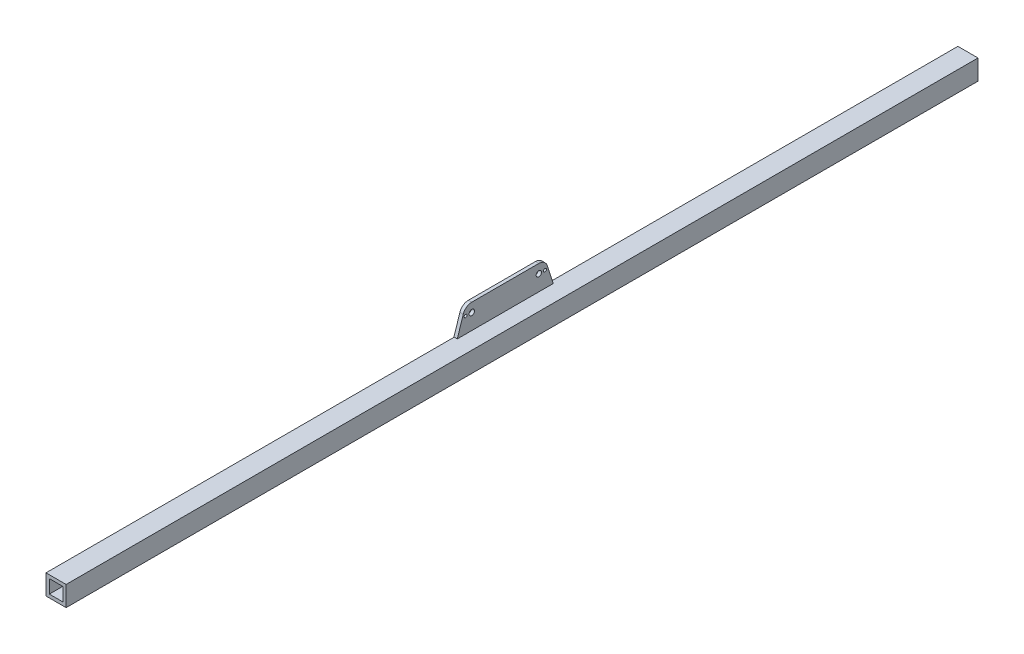
ISO-10303-21;
HEADER;
FILE_DESCRIPTION(('STEP AP214'),'2;1');
FILE_NAME('part.step','',(''),(''),'','','');
FILE_SCHEMA(('AUTOMOTIVE_DESIGN { 1 0 10303 214 1 1 1 1 }'));
ENDSEC;
DATA;
#1=APPLICATION_CONTEXT('core data for automotive mechanical design processes');
#2=APPLICATION_PROTOCOL_DEFINITION('international standard','automotive_design',2000,#1);
#3=PRODUCT_CONTEXT('',#1,'mechanical');
#4=PRODUCT('Part','Part','',(#3));
#5=PRODUCT_RELATED_PRODUCT_CATEGORY('part','',(#4));
#6=PRODUCT_DEFINITION_FORMATION('','',#4);
#7=PRODUCT_DEFINITION_CONTEXT('part definition',#1,'design');
#8=PRODUCT_DEFINITION('design','',#6,#7);
#9=PRODUCT_DEFINITION_SHAPE('','',#8);
#10=(LENGTH_UNIT() NAMED_UNIT(*) SI_UNIT(.MILLI.,.METRE.));
#11=(NAMED_UNIT(*) PLANE_ANGLE_UNIT() SI_UNIT($,.RADIAN.));
#12=(NAMED_UNIT(*) SI_UNIT($,.STERADIAN.) SOLID_ANGLE_UNIT());
#13=UNCERTAINTY_MEASURE_WITH_UNIT(LENGTH_MEASURE(1.E-05),#10,'distance_accuracy_value','');
#14=(GEOMETRIC_REPRESENTATION_CONTEXT(3) GLOBAL_UNCERTAINTY_ASSIGNED_CONTEXT((#13)) GLOBAL_UNIT_ASSIGNED_CONTEXT((#10,
#11,#12)) REPRESENTATION_CONTEXT('',''));
#15=CARTESIAN_POINT('',(0.,0.,0.));
#16=DIRECTION('',(0.,0.,1.));
#17=DIRECTION('',(1.,0.,0.));
#18=AXIS2_PLACEMENT_3D('',#15,#16,#17);
#19=CARTESIAN_POINT('',(-6.35,27.2262178550397,-391.991213097812));
#20=CARTESIAN_POINT('',(-6.35,27.3173707739215,-392.021753734183));
#21=CARTESIAN_POINT('',(-6.35,27.499676611685,-392.082835006924));
#22=CARTESIAN_POINT('',(-6.35,27.7689805937755,-392.186190582249));
#23=CARTESIAN_POINT('',(-6.35,28.0348461149055,-392.297987590747));
#24=CARTESIAN_POINT('',(-6.35,28.2966895976227,-392.418946559684));
#25=CARTESIAN_POINT('',(-6.35,28.6401452697693,-392.591950530516));
#26=CARTESIAN_POINT('',(-6.35,28.9744595417508,-392.782359956122));
#27=CARTESIAN_POINT('',(-6.35,29.298488123748,-392.989491067887));
#28=CARTESIAN_POINT('',(-6.35,29.6442417287719,-393.227477956135));
#29=CARTESIAN_POINT('',(-6.35,30.0800545990652,-393.56566036437));
#30=CARTESIAN_POINT('',(-6.35,30.5846333282074,-394.02614449053));
#31=CARTESIAN_POINT('',(-6.35,31.0505530347622,-394.525938749404));
#32=CARTESIAN_POINT('',(-6.35,31.4733481418253,-395.063532300767));
#33=CARTESIAN_POINT('',(-6.35,31.8532081181751,-395.631258779186));
#34=CARTESIAN_POINT('',(-6.35,32.2962454155091,-396.426610528844));
#35=CARTESIAN_POINT('',(-6.35,32.71705570741,-397.463033708927));
#36=CARTESIAN_POINT('',(-6.35,32.9358696588289,-398.393913098835));
#37=CARTESIAN_POINT('',(-6.35,33.0273729579738,-399.035207634627));
#38=CARTESIAN_POINT('',(-6.35,33.0630756412302,-399.38403619713));
#39=CARTESIAN_POINT('',(-6.35,33.0830265317926,-399.750910150479));
#40=CARTESIAN_POINT('',(-6.35,33.0848497712993,-399.967870418303));
#41=CARTESIAN_POINT('',(-6.35,33.0855399524994,-400.05));
#42=B_SPLINE_CURVE_WITH_KNOTS('',3,(#19,#20,#21,#22,#23,#24,#25,#26,#27,#28,#29,#30,#31,#32,#33,
#34,#35,#36,#37,#38,#39,#40,#41),.UNSPECIFIED.,.F.,.F.,(4,1,1,1,1,1,1,1,1,1,1,1,1,1,1,1,1,1,1,1,
4),(0.,0.0270825226870517,0.0541650453741034,0.0812475680611551,0.108330090748206,
0.135412613435259,0.189577658809362,0.216660181496413,0.243742704183465,0.307821112222937,
0.371897307209133,0.436011013062701,0.500107188986833,0.564389200661177,0.628263610263641,
0.756365308011367,0.87811555285971,0.896531502333321,0.93887405730568,0.976860979410322,1.),.UNSPECIFIED.);
#43=DIRECTION('',(-1.,0.,0.));
#44=VECTOR('',#43,1.);
#45=SURFACE_OF_LINEAR_EXTRUSION('',#42,#44);
#46=CARTESIAN_POINT('',(-9.525,27.2262178550397,-391.991213097812));
#47=CARTESIAN_POINT('',(-9.525,27.3173707739215,-392.021753734183));
#48=CARTESIAN_POINT('',(-9.525,27.499676611685,-392.082835006924));
#49=CARTESIAN_POINT('',(-9.525,27.7689805937755,-392.186190582249));
#50=CARTESIAN_POINT('',(-9.525,28.0348461149055,-392.297987590747));
#51=CARTESIAN_POINT('',(-9.525,28.2966895976227,-392.418946559684));
#52=CARTESIAN_POINT('',(-9.525,28.6401452697693,-392.591950530516));
#53=CARTESIAN_POINT('',(-9.525,28.9744595417508,-392.782359956122));
#54=CARTESIAN_POINT('',(-9.525,29.298488123748,-392.989491067887));
#55=CARTESIAN_POINT('',(-9.525,29.6442417287719,-393.227477956135));
#56=CARTESIAN_POINT('',(-9.525,30.0800545990652,-393.56566036437));
#57=CARTESIAN_POINT('',(-9.525,30.5846333282074,-394.02614449053));
#58=CARTESIAN_POINT('',(-9.525,31.0505530347622,-394.525938749404));
#59=CARTESIAN_POINT('',(-9.525,31.4733481418253,-395.063532300767));
#60=CARTESIAN_POINT('',(-9.525,31.8532081181751,-395.631258779186));
#61=CARTESIAN_POINT('',(-9.525,32.2962454155091,-396.426610528844));
#62=CARTESIAN_POINT('',(-9.525,32.71705570741,-397.463033708927));
#63=CARTESIAN_POINT('',(-9.525,32.9358696588289,-398.393913098835));
#64=CARTESIAN_POINT('',(-9.525,33.0273729579738,-399.035207634627));
#65=CARTESIAN_POINT('',(-9.525,33.0630756412302,-399.38403619713));
#66=CARTESIAN_POINT('',(-9.525,33.0830265317926,-399.750910150479));
#67=CARTESIAN_POINT('',(-9.525,33.0848497712993,-399.967870418303));
#68=CARTESIAN_POINT('',(-9.525,33.0855399524994,-400.05));
#69=B_SPLINE_CURVE_WITH_KNOTS('',3,(#46,#47,#48,#49,#50,#51,#52,#53,#54,#55,#56,#57,#58,#59,#60,
#61,#62,#63,#64,#65,#66,#67,#68),.UNSPECIFIED.,.F.,.F.,(4,1,1,1,1,1,1,1,1,1,1,1,1,1,1,1,1,1,1,1,
4),(0.,0.0270825226870517,0.0541650453741034,0.0812475680611551,0.108330090748206,
0.135412613435259,0.189577658809362,0.216660181496413,0.243742704183465,0.307821112222937,
0.371897307209133,0.436011013062701,0.500107188986833,0.564389200661177,0.628263610263641,
0.756365308011367,0.87811555285971,0.896531502333321,0.93887405730568,0.976860979410322,1.),.UNSPECIFIED.);
#70=CARTESIAN_POINT('',(-9.525,27.2262178550397,-391.991213097812));
#71=VERTEX_POINT('',#70);
#72=CARTESIAN_POINT('',(-9.525,33.0855399524994,-400.05));
#73=VERTEX_POINT('',#72);
#74=EDGE_CURVE('E138',#71,#73,#69,.T.);
#75=ORIENTED_EDGE('',*,*,#74,.F.);
#76=DIRECTION('',(-1.,0.,0.));
#77=VECTOR('',#76,1.);
#78=CARTESIAN_POINT('',(-6.35,27.2262178550397,-391.991213097812));
#79=LINE('',#78,#77);
#80=CARTESIAN_POINT('',(-6.35,27.2262178550397,-391.991213097812));
#81=VERTEX_POINT('',#80);
#82=EDGE_CURVE('E12',#81,#71,#79,.T.);
#83=ORIENTED_EDGE('',*,*,#82,.F.);
#84=CARTESIAN_POINT('',(-6.35,33.0855399524994,-400.05));
#85=VERTEX_POINT('',#84);
#86=EDGE_CURVE('E163',#81,#85,#42,.T.);
#87=ORIENTED_EDGE('',*,*,#86,.T.);
#88=DIRECTION('',(-1.,0.,0.));
#89=VECTOR('',#88,1.);
#90=CARTESIAN_POINT('',(-6.35,33.0855399524994,-400.05));
#91=LINE('',#90,#89);
#92=EDGE_CURVE('E53',#85,#73,#91,.T.);
#93=ORIENTED_EDGE('',*,*,#92,.T.);
#94=EDGE_LOOP('',(#75,#83,#87,#93));
#95=FACE_BOUND('',#94,.T.);
#96=ADVANCED_FACE('F49',(#95),#45,.T.);
#97=CARTESIAN_POINT('',(-6.35,9.77744265715969,-386.335138125378));
#98=DIRECTION('',(0.,0.30835733563451,0.951270599545884));
#99=DIRECTION('',(0.,-0.951270599545884,0.30835733563451));
#100=AXIS2_PLACEMENT_3D('',#97,#98,#99);
#101=PLANE('',#100);
#102=DIRECTION('',(0.,0.951270599545884,-0.30835733563451));
#103=VECTOR('',#102,1.);
#104=CARTESIAN_POINT('',(-9.525,9.77744265715969,-386.335138125378));
#105=LINE('',#104,#103);
#106=CARTESIAN_POINT('',(-9.525,9.77744265715969,-386.335138125378));
#107=VERTEX_POINT('',#106);
#108=EDGE_CURVE('E161',#107,#71,#105,.T.);
#109=ORIENTED_EDGE('',*,*,#108,.F.);
#110=DIRECTION('',(-1.,0.,0.));
#111=VECTOR('',#110,1.);
#112=CARTESIAN_POINT('',(-6.35,9.77744265715969,-386.335138125378));
#113=LINE('',#112,#111);
#114=CARTESIAN_POINT('',(-6.35,9.77744265715969,-386.335138125378));
#115=VERTEX_POINT('',#114);
#116=EDGE_CURVE('E59',#115,#107,#113,.T.);
#117=ORIENTED_EDGE('',*,*,#116,.F.);
#118=DIRECTION('',(0.,0.951270599545884,-0.30835733563451));
#119=VECTOR('',#118,1.);
#120=CARTESIAN_POINT('',(-6.35,9.77744265715969,-386.335138125378));
#121=LINE('',#120,#119);
#122=EDGE_CURVE('E125',#115,#81,#121,.T.);
#123=ORIENTED_EDGE('',*,*,#122,.T.);
#124=ORIENTED_EDGE('',*,*,#82,.T.);
#125=EDGE_LOOP('',(#109,#117,#123,#124));
#126=FACE_BOUND('',#125,.T.);
#127=ADVANCED_FACE('F171',(#126),#101,.T.);
#128=CARTESIAN_POINT('',(-6.35,9.7774426571583,-477.264861874622));
#129=DIRECTION('',(0.,-1.,0.));
#130=DIRECTION('',(0.,0.,-1.));
#131=AXIS2_PLACEMENT_3D('',#128,#129,#130);
#132=PLANE('',#131);
#133=DIRECTION('',(0.,0.,1.));
#134=VECTOR('',#133,1.);
#135=CARTESIAN_POINT('',(-9.525,9.7774426571583,-477.264861874622));
#136=LINE('',#135,#134);
#137=CARTESIAN_POINT('',(-9.525,9.7774426571583,-477.264861874622));
#138=VERTEX_POINT('',#137);
#139=EDGE_CURVE('E112',#138,#107,#136,.T.);
#140=ORIENTED_EDGE('',*,*,#139,.F.);
#141=DIRECTION('',(-1.,0.,0.));
#142=VECTOR('',#141,1.);
#143=CARTESIAN_POINT('',(-6.35,9.7774426571583,-477.264861874622));
#144=LINE('',#143,#142);
#145=CARTESIAN_POINT('',(-6.35,9.7774426571583,-477.264861874622));
#146=VERTEX_POINT('',#145);
#147=EDGE_CURVE('E107',#146,#138,#144,.T.);
#148=ORIENTED_EDGE('',*,*,#147,.F.);
#149=DIRECTION('',(0.,0.,1.));
#150=VECTOR('',#149,1.);
#151=CARTESIAN_POINT('',(-6.35,9.7774426571583,-477.264861874622));
#152=LINE('',#151,#150);
#153=EDGE_CURVE('E110',#146,#115,#152,.T.);
#154=ORIENTED_EDGE('',*,*,#153,.T.);
#155=ORIENTED_EDGE('',*,*,#116,.T.);
#156=EDGE_LOOP('',(#140,#148,#154,#155));
#157=FACE_BOUND('',#156,.T.);
#158=ADVANCED_FACE('F109',(#157),#132,.T.);
#159=CARTESIAN_POINT('',(-6.35,27.2262178550397,-471.608786902188));
#160=DIRECTION('',(0.,0.308357335634504,-0.951270599545886));
#161=DIRECTION('',(0.,0.951270599545886,0.308357335634504));
#162=AXIS2_PLACEMENT_3D('',#159,#160,#161);
#163=PLANE('',#162);
#164=DIRECTION('',(0.,-0.951270599545886,-0.308357335634504));
#165=VECTOR('',#164,1.);
#166=CARTESIAN_POINT('',(-9.525,27.2262178550397,-471.608786902188));
#167=LINE('',#166,#165);
#168=CARTESIAN_POINT('',(-9.525,27.2262178550397,-471.608786902188));
#169=VERTEX_POINT('',#168);
#170=EDGE_CURVE('E155',#169,#138,#167,.T.);
#171=ORIENTED_EDGE('',*,*,#170,.F.);
#172=DIRECTION('',(-1.,0.,0.));
#173=VECTOR('',#172,1.);
#174=CARTESIAN_POINT('',(-6.35,27.2262178550397,-471.608786902188));
#175=LINE('',#174,#173);
#176=CARTESIAN_POINT('',(-6.35,27.2262178550397,-471.608786902188));
#177=VERTEX_POINT('',#176);
#178=EDGE_CURVE('E117',#177,#169,#175,.T.);
#179=ORIENTED_EDGE('',*,*,#178,.F.);
#180=DIRECTION('',(0.,-0.951270599545886,-0.308357335634504));
#181=VECTOR('',#180,1.);
#182=CARTESIAN_POINT('',(-6.35,27.2262178550397,-471.608786902188));
#183=LINE('',#182,#181);
#184=EDGE_CURVE('E123',#177,#146,#183,.T.);
#185=ORIENTED_EDGE('',*,*,#184,.T.);
#186=ORIENTED_EDGE('',*,*,#147,.T.);
#187=EDGE_LOOP('',(#171,#179,#185,#186));
#188=FACE_BOUND('',#187,.T.);
#189=ADVANCED_FACE('F127',(#188),#163,.T.);
#190=CARTESIAN_POINT('',(-6.35,33.0855399524994,-463.55));
#191=CARTESIAN_POINT('',(-6.35,33.0845952142305,-463.646128521055));
#192=CARTESIAN_POINT('',(-6.35,33.0827057376926,-463.838385563164));
#193=CARTESIAN_POINT('',(-6.35,33.0674284759793,-464.126436973498));
#194=CARTESIAN_POINT('',(-6.35,33.0430608524108,-464.413820454854));
#195=CARTESIAN_POINT('',(-6.35,33.0087375001941,-464.700203047028));
#196=CARTESIAN_POINT('',(-6.35,32.9500709851079,-465.080269373689));
#197=CARTESIAN_POINT('',(-6.35,32.8720283548254,-465.457006854793));
#198=CARTESIAN_POINT('',(-6.35,32.7749072081668,-465.82911611601));
#199=CARTESIAN_POINT('',(-6.35,32.6551329387257,-466.231406357946));
#200=CARTESIAN_POINT('',(-6.35,32.4678160519974,-466.750263354747));
#201=CARTESIAN_POINT('',(-6.35,32.1853615937583,-467.372247923196));
#202=CARTESIAN_POINT('',(-6.35,31.8535917688086,-467.969578867812));
#203=CARTESIAN_POINT('',(-6.35,31.4725668016052,-468.537542337942));
#204=CARTESIAN_POINT('',(-6.35,31.0496379042901,-469.073954589657));
#205=CARTESIAN_POINT('',(-6.35,30.4296569691387,-469.740655491528));
#206=CARTESIAN_POINT('',(-6.35,29.5734980096749,-470.460548640627));
#207=CARTESIAN_POINT('',(-6.35,28.7554526970163,-470.955743410323));
#208=CARTESIAN_POINT('',(-6.35,28.1736237727812,-471.240535682596));
#209=CARTESIAN_POINT('',(-6.35,27.85280261552,-471.382062434908));
#210=CARTESIAN_POINT('',(-6.35,27.5099582185498,-471.514169404431));
#211=CARTESIAN_POINT('',(-6.35,27.3041325038923,-471.58280508902));
#212=CARTESIAN_POINT('',(-6.35,27.2262178550397,-471.608786902188));
#213=B_SPLINE_CURVE_WITH_KNOTS('',3,(#190,#191,#192,#193,#194,#195,#196,#197,#198,#199,#200,
#201,#202,#203,#204,#205,#206,#207,#208,#209,#210,#211,#212),.UNSPECIFIED.,.F.,.F.,(4,1,1,1,1,1,
1,1,1,1,1,1,1,1,1,1,1,1,1,1,4),(0.,0.0270825226870185,0.0541650453740373,0.0812475680610556,
0.108330090748074,0.135412613435093,0.189577658809129,0.216660181496148,0.243742704183166,
0.307821112226502,0.371897307216465,0.436011013066379,0.500107188986409,0.564389200670418,
0.628263610276075,0.756365308010581,0.878115552865022,0.896531503760055,0.938874057309861,
0.976860974983559,1.),.UNSPECIFIED.);
#214=DIRECTION('',(-1.,0.,0.));
#215=VECTOR('',#214,1.);
#216=SURFACE_OF_LINEAR_EXTRUSION('',#213,#215);
#217=CARTESIAN_POINT('',(-9.525,33.0855399524994,-463.55));
#218=CARTESIAN_POINT('',(-9.525,33.0845952142305,-463.646128521055));
#219=CARTESIAN_POINT('',(-9.525,33.0827057376926,-463.838385563164));
#220=CARTESIAN_POINT('',(-9.525,33.0674284759793,-464.126436973498));
#221=CARTESIAN_POINT('',(-9.525,33.0430608524108,-464.413820454854));
#222=CARTESIAN_POINT('',(-9.525,33.0087375001941,-464.700203047028));
#223=CARTESIAN_POINT('',(-9.525,32.9500709851079,-465.080269373689));
#224=CARTESIAN_POINT('',(-9.525,32.8720283548254,-465.457006854793));
#225=CARTESIAN_POINT('',(-9.525,32.7749072081668,-465.82911611601));
#226=CARTESIAN_POINT('',(-9.525,32.6551329387257,-466.231406357946));
#227=CARTESIAN_POINT('',(-9.525,32.4678160519974,-466.750263354747));
#228=CARTESIAN_POINT('',(-9.525,32.1853615937583,-467.372247923196));
#229=CARTESIAN_POINT('',(-9.525,31.8535917688086,-467.969578867812));
#230=CARTESIAN_POINT('',(-9.525,31.4725668016052,-468.537542337942));
#231=CARTESIAN_POINT('',(-9.525,31.0496379042901,-469.073954589657));
#232=CARTESIAN_POINT('',(-9.525,30.4296569691387,-469.740655491528));
#233=CARTESIAN_POINT('',(-9.525,29.5734980096749,-470.460548640627));
#234=CARTESIAN_POINT('',(-9.525,28.7554526970163,-470.955743410323));
#235=CARTESIAN_POINT('',(-9.525,28.1736237727812,-471.240535682596));
#236=CARTESIAN_POINT('',(-9.525,27.85280261552,-471.382062434908));
#237=CARTESIAN_POINT('',(-9.525,27.5099582185498,-471.514169404431));
#238=CARTESIAN_POINT('',(-9.525,27.3041325038923,-471.58280508902));
#239=CARTESIAN_POINT('',(-9.525,27.2262178550397,-471.608786902188));
#240=B_SPLINE_CURVE_WITH_KNOTS('',3,(#217,#218,#219,#220,#221,#222,#223,#224,#225,#226,#227,
#228,#229,#230,#231,#232,#233,#234,#235,#236,#237,#238,#239),.UNSPECIFIED.,.F.,.F.,(4,1,1,1,1,1,
1,1,1,1,1,1,1,1,1,1,1,1,1,1,4),(0.,0.0270825226870185,0.0541650453740373,0.0812475680610556,
0.108330090748074,0.135412613435093,0.189577658809129,0.216660181496148,0.243742704183166,
0.307821112226502,0.371897307216465,0.436011013066379,0.500107188986409,0.564389200670418,
0.628263610276075,0.756365308010581,0.878115552865022,0.896531503760055,0.938874057309861,
0.976860974983559,1.),.UNSPECIFIED.);
#241=CARTESIAN_POINT('',(-9.525,33.0855399524994,-463.55));
#242=VERTEX_POINT('',#241);
#243=EDGE_CURVE('E150',#242,#169,#240,.T.);
#244=ORIENTED_EDGE('',*,*,#243,.F.);
#245=DIRECTION('',(-1.,0.,0.));
#246=VECTOR('',#245,1.);
#247=CARTESIAN_POINT('',(-6.35,33.0855399524994,-463.55));
#248=LINE('',#247,#246);
#249=CARTESIAN_POINT('',(-6.35,33.0855399524994,-463.55));
#250=VERTEX_POINT('',#249);
#251=EDGE_CURVE('E166',#250,#242,#248,.T.);
#252=ORIENTED_EDGE('',*,*,#251,.F.);
#253=EDGE_CURVE('E128',#250,#177,#213,.T.);
#254=ORIENTED_EDGE('',*,*,#253,.T.);
#255=ORIENTED_EDGE('',*,*,#178,.T.);
#256=EDGE_LOOP('',(#244,#252,#254,#255));
#257=FACE_BOUND('',#256,.T.);
#258=ADVANCED_FACE('F184',(#257),#216,.T.);
#259=CARTESIAN_POINT('',(-6.35,33.0855399524994,-400.05));
#260=DIRECTION('',(0.,1.,0.));
#261=DIRECTION('',(0.,0.,1.));
#262=AXIS2_PLACEMENT_3D('',#259,#260,#261);
#263=PLANE('',#262);
#264=DIRECTION('',(0.,0.,-1.));
#265=VECTOR('',#264,1.);
#266=CARTESIAN_POINT('',(-9.525,33.0855399524994,-400.05));
#267=LINE('',#266,#265);
#268=EDGE_CURVE('E143',#73,#242,#267,.T.);
#269=ORIENTED_EDGE('',*,*,#268,.F.);
#270=ORIENTED_EDGE('',*,*,#92,.F.);
#271=DIRECTION('',(0.,0.,-1.));
#272=VECTOR('',#271,1.);
#273=CARTESIAN_POINT('',(-6.35,33.0855399524994,-400.05));
#274=LINE('',#273,#272);
#275=EDGE_CURVE('E130',#85,#250,#274,.T.);
#276=ORIENTED_EDGE('',*,*,#275,.T.);
#277=ORIENTED_EDGE('',*,*,#251,.T.);
#278=EDGE_LOOP('',(#269,#270,#276,#277));
#279=FACE_BOUND('',#278,.T.);
#280=ADVANCED_FACE('F168',(#279),#263,.T.);
#281=CARTESIAN_POINT('',(-6.35,31.4652096811838,-395.067216607806));
#282=DIRECTION('',(1.,0.,0.));
#283=DIRECTION('',(0.,0.,-1.));
#284=AXIS2_PLACEMENT_3D('',#281,#282,#283);
#285=PLANE('',#284);
#286=CARTESIAN_POINT('',(-6.35,24.6139369133275,-394.208));
#287=DIRECTION('',(-1.,0.,0.));
#288=DIRECTION('',(0.,0.,1.));
#289=AXIS2_PLACEMENT_3D('',#286,#287,#288);
#290=CIRCLE('',#289,1.36705665926176);
#291=CARTESIAN_POINT('',(-6.35,24.6139369133275,-392.840943340738));
#292=VERTEX_POINT('',#291);
#293=EDGE_CURVE('E144',#292,#292,#290,.T.);
#294=ORIENTED_EDGE('',*,*,#293,.T.);
#295=EDGE_LOOP('',(#294));
#296=FACE_BOUND('',#295,.T.);
#297=CARTESIAN_POINT('',(-6.35,24.6139369133275,-463.55));
#298=DIRECTION('',(-1.,0.,0.));
#299=DIRECTION('',(0.,0.,1.));
#300=AXIS2_PLACEMENT_3D('',#297,#298,#299);
#301=CIRCLE('',#300,2.55755172390901);
#302=CARTESIAN_POINT('',(-6.35,24.6139369133275,-460.992448276091));
#303=VERTEX_POINT('',#302);
#304=EDGE_CURVE('E228',#303,#303,#301,.T.);
#305=ORIENTED_EDGE('',*,*,#304,.T.);
#306=EDGE_LOOP('',(#305));
#307=FACE_BOUND('',#306,.T.);
#308=CARTESIAN_POINT('',(-6.35,24.6139369133275,-400.05));
#309=DIRECTION('',(-1.,0.,0.));
#310=DIRECTION('',(0.,0.,1.));
#311=AXIS2_PLACEMENT_3D('',#308,#309,#310);
#312=CIRCLE('',#311,2.55724226403475);
#313=CARTESIAN_POINT('',(-6.35,24.6139369133275,-397.492757735965));
#314=VERTEX_POINT('',#313);
#315=EDGE_CURVE('E237',#314,#314,#312,.T.);
#316=ORIENTED_EDGE('',*,*,#315,.T.);
#317=EDGE_LOOP('',(#316));
#318=FACE_BOUND('',#317,.T.);
#319=CARTESIAN_POINT('',(-6.35,24.6139369133275,-469.392));
#320=DIRECTION('',(-1.,0.,0.));
#321=DIRECTION('',(0.,0.,1.));
#322=AXIS2_PLACEMENT_3D('',#319,#320,#321);
#323=CIRCLE('',#322,1.36705665926164);
#324=CARTESIAN_POINT('',(-6.35,24.6139369133275,-468.024943340738));
#325=VERTEX_POINT('',#324);
#326=EDGE_CURVE('E221',#325,#325,#323,.T.);
#327=ORIENTED_EDGE('',*,*,#326,.T.);
#328=EDGE_LOOP('',(#327));
#329=FACE_BOUND('',#328,.T.);
#330=ORIENTED_EDGE('',*,*,#86,.F.);
#331=ORIENTED_EDGE('',*,*,#122,.F.);
#332=ORIENTED_EDGE('',*,*,#153,.F.);
#333=ORIENTED_EDGE('',*,*,#184,.F.);
#334=ORIENTED_EDGE('',*,*,#253,.F.);
#335=ORIENTED_EDGE('',*,*,#275,.F.);
#336=EDGE_LOOP('',(#330,#331,#332,#333,#334,#335));
#337=FACE_BOUND('',#336,.T.);
#338=ADVANCED_FACE('F121',(#296,#307,#318,#329,#337),#285,.T.);
#339=CARTESIAN_POINT('',(-9.525,31.4652096811838,-395.067216607806));
#340=DIRECTION('',(1.,0.,0.));
#341=DIRECTION('',(0.,0.,-1.));
#342=AXIS2_PLACEMENT_3D('',#339,#340,#341);
#343=PLANE('',#342);
#344=CARTESIAN_POINT('',(-9.525,24.6139369133275,-394.208));
#345=DIRECTION('',(-1.,0.,0.));
#346=DIRECTION('',(0.,0.,1.));
#347=AXIS2_PLACEMENT_3D('',#344,#345,#346);
#348=CIRCLE('',#347,1.36705665926176);
#349=CARTESIAN_POINT('',(-9.525,24.6139369133275,-392.840943340738));
#350=VERTEX_POINT('',#349);
#351=EDGE_CURVE('E220',#350,#350,#348,.T.);
#352=ORIENTED_EDGE('',*,*,#351,.F.);
#353=EDGE_LOOP('',(#352));
#354=FACE_BOUND('',#353,.T.);
#355=CARTESIAN_POINT('',(-9.525,24.6139369133275,-463.55));
#356=DIRECTION('',(-1.,0.,0.));
#357=DIRECTION('',(0.,0.,1.));
#358=AXIS2_PLACEMENT_3D('',#355,#356,#357);
#359=CIRCLE('',#358,2.55755172390901);
#360=CARTESIAN_POINT('',(-9.525,24.6139369133275,-460.992448276091));
#361=VERTEX_POINT('',#360);
#362=EDGE_CURVE('E232',#361,#361,#359,.T.);
#363=ORIENTED_EDGE('',*,*,#362,.F.);
#364=EDGE_LOOP('',(#363));
#365=FACE_BOUND('',#364,.T.);
#366=CARTESIAN_POINT('',(-9.525,24.6139369133275,-400.05));
#367=DIRECTION('',(-1.,0.,0.));
#368=DIRECTION('',(0.,0.,1.));
#369=AXIS2_PLACEMENT_3D('',#366,#367,#368);
#370=CIRCLE('',#369,2.55724226403475);
#371=CARTESIAN_POINT('',(-9.525,24.6139369133275,-397.492757735965));
#372=VERTEX_POINT('',#371);
#373=EDGE_CURVE('E231',#372,#372,#370,.T.);
#374=ORIENTED_EDGE('',*,*,#373,.F.);
#375=EDGE_LOOP('',(#374));
#376=FACE_BOUND('',#375,.T.);
#377=CARTESIAN_POINT('',(-9.525,24.6139369133275,-469.392));
#378=DIRECTION('',(-1.,0.,0.));
#379=DIRECTION('',(0.,0.,1.));
#380=AXIS2_PLACEMENT_3D('',#377,#378,#379);
#381=CIRCLE('',#380,1.36705665926164);
#382=CARTESIAN_POINT('',(-9.525,24.6139369133275,-468.024943340738));
#383=VERTEX_POINT('',#382);
#384=EDGE_CURVE('E225',#383,#383,#381,.T.);
#385=ORIENTED_EDGE('',*,*,#384,.F.);
#386=EDGE_LOOP('',(#385));
#387=FACE_BOUND('',#386,.T.);
#388=ORIENTED_EDGE('',*,*,#74,.T.);
#389=ORIENTED_EDGE('',*,*,#268,.T.);
#390=ORIENTED_EDGE('',*,*,#243,.T.);
#391=ORIENTED_EDGE('',*,*,#170,.T.);
#392=ORIENTED_EDGE('',*,*,#139,.T.);
#393=ORIENTED_EDGE('',*,*,#108,.T.);
#394=EDGE_LOOP('',(#388,#389,#390,#391,#392,#393));
#395=FACE_BOUND('',#394,.T.);
#396=ADVANCED_FACE('F170',(#354,#365,#376,#387,#395),#343,.F.);
#397=CARTESIAN_POINT('',(-6.35,24.6139369133275,-469.392));
#398=DIRECTION('',(-1.,0.,0.));
#399=DIRECTION('',(0.,0.,1.));
#400=AXIS2_PLACEMENT_3D('',#397,#398,#399);
#401=CYLINDRICAL_SURFACE('',#400,1.36705665926164);
#402=ORIENTED_EDGE('',*,*,#326,.F.);
#403=EDGE_LOOP('',(#402));
#404=FACE_BOUND('',#403,.T.);
#405=ORIENTED_EDGE('',*,*,#384,.T.);
#406=EDGE_LOOP('',(#405));
#407=FACE_BOUND('',#406,.T.);
#408=ADVANCED_FACE('F195',(#404,#407),#401,.F.);
#409=CARTESIAN_POINT('',(-6.35,24.6139369133275,-400.05));
#410=DIRECTION('',(-1.,0.,0.));
#411=DIRECTION('',(0.,0.,1.));
#412=AXIS2_PLACEMENT_3D('',#409,#410,#411);
#413=CYLINDRICAL_SURFACE('',#412,2.55724226403475);
#414=ORIENTED_EDGE('',*,*,#315,.F.);
#415=EDGE_LOOP('',(#414));
#416=FACE_BOUND('',#415,.T.);
#417=ORIENTED_EDGE('',*,*,#373,.T.);
#418=EDGE_LOOP('',(#417));
#419=FACE_BOUND('',#418,.T.);
#420=ADVANCED_FACE('F200',(#416,#419),#413,.F.);
#421=CARTESIAN_POINT('',(-6.35,24.6139369133275,-463.55));
#422=DIRECTION('',(-1.,0.,0.));
#423=DIRECTION('',(0.,0.,1.));
#424=AXIS2_PLACEMENT_3D('',#421,#422,#423);
#425=CYLINDRICAL_SURFACE('',#424,2.55755172390901);
#426=ORIENTED_EDGE('',*,*,#304,.F.);
#427=EDGE_LOOP('',(#426));
#428=FACE_BOUND('',#427,.T.);
#429=ORIENTED_EDGE('',*,*,#362,.T.);
#430=EDGE_LOOP('',(#429));
#431=FACE_BOUND('',#430,.T.);
#432=ADVANCED_FACE('F203',(#428,#431),#425,.F.);
#433=CARTESIAN_POINT('',(-6.35,24.6139369133275,-394.208));
#434=DIRECTION('',(-1.,0.,0.));
#435=DIRECTION('',(0.,0.,1.));
#436=AXIS2_PLACEMENT_3D('',#433,#434,#435);
#437=CYLINDRICAL_SURFACE('',#436,1.36705665926176);
#438=ORIENTED_EDGE('',*,*,#293,.F.);
#439=EDGE_LOOP('',(#438));
#440=FACE_BOUND('',#439,.T.);
#441=ORIENTED_EDGE('',*,*,#351,.T.);
#442=EDGE_LOOP('',(#441));
#443=FACE_BOUND('',#442,.T.);
#444=ADVANCED_FACE('F210',(#440,#443),#437,.F.);
#445=CLOSED_SHELL('',(#96,#127,#158,#189,#258,#280,#338,#396,#408,#420,#432,#444));
#446=MANIFOLD_SOLID_BREP('B2',#445);
#447=CARTESIAN_POINT('',(9.52500000000001,-9.52499999999999,-863.6));
#448=DIRECTION('',(1.,0.,0.));
#449=DIRECTION('',(0.,0.,-1.));
#450=AXIS2_PLACEMENT_3D('',#447,#448,#449);
#451=PLANE('',#450);
#452=DIRECTION('',(0.,1.,0.));
#453=VECTOR('',#452,1.);
#454=CARTESIAN_POINT('',(9.52500000000001,-9.52499999999999,0.));
#455=LINE('',#454,#453);
#456=CARTESIAN_POINT('',(9.52500000000001,-9.52499999999999,0.));
#457=VERTEX_POINT('',#456);
#458=CARTESIAN_POINT('',(9.52500000000001,9.52500000000001,0.));
#459=VERTEX_POINT('',#458);
#460=EDGE_CURVE('E401',#457,#459,#455,.T.);
#461=ORIENTED_EDGE('',*,*,#460,.F.);
#462=DIRECTION('',(0.,0.,1.));
#463=VECTOR('',#462,1.);
#464=CARTESIAN_POINT('',(9.52500000000001,-9.52499999999999,-863.6));
#465=LINE('',#464,#463);
#466=CARTESIAN_POINT('',(9.52500000000001,-9.52499999999999,-863.6));
#467=VERTEX_POINT('',#466);
#468=EDGE_CURVE('E47',#467,#457,#465,.T.);
#469=ORIENTED_EDGE('',*,*,#468,.F.);
#470=DIRECTION('',(0.,1.,0.));
#471=VECTOR('',#470,1.);
#472=CARTESIAN_POINT('',(9.52500000000001,-9.52499999999999,-863.6));
#473=LINE('',#472,#471);
#474=CARTESIAN_POINT('',(9.52500000000001,9.52500000000001,-863.6));
#475=VERTEX_POINT('',#474);
#476=EDGE_CURVE('E430',#467,#475,#473,.T.);
#477=ORIENTED_EDGE('',*,*,#476,.T.);
#478=DIRECTION('',(0.,0.,1.));
#479=VECTOR('',#478,1.);
#480=CARTESIAN_POINT('',(9.52500000000001,9.52500000000001,-863.6));
#481=LINE('',#480,#479);
#482=EDGE_CURVE('E333',#475,#459,#481,.T.);
#483=ORIENTED_EDGE('',*,*,#482,.T.);
#484=EDGE_LOOP('',(#461,#469,#477,#483));
#485=FACE_BOUND('',#484,.T.);
#486=ADVANCED_FACE('F330',(#485),#451,.T.);
#487=CARTESIAN_POINT('',(-9.525,-9.52499999999999,-863.6));
#488=DIRECTION('',(0.,-1.,0.));
#489=DIRECTION('',(0.,0.,-1.));
#490=AXIS2_PLACEMENT_3D('',#487,#488,#489);
#491=PLANE('',#490);
#492=DIRECTION('',(1.,0.,0.));
#493=VECTOR('',#492,1.);
#494=CARTESIAN_POINT('',(-9.525,-9.52499999999999,0.));
#495=LINE('',#494,#493);
#496=CARTESIAN_POINT('',(-9.525,-9.52499999999999,0.));
#497=VERTEX_POINT('',#496);
#498=EDGE_CURVE('E434',#497,#457,#495,.T.);
#499=ORIENTED_EDGE('',*,*,#498,.F.);
#500=DIRECTION('',(0.,0.,1.));
#501=VECTOR('',#500,1.);
#502=CARTESIAN_POINT('',(-9.525,-9.52499999999999,-863.6));
#503=LINE('',#502,#501);
#504=CARTESIAN_POINT('',(-9.525,-9.52499999999999,-863.6));
#505=VERTEX_POINT('',#504);
#506=EDGE_CURVE('E338',#505,#497,#503,.T.);
#507=ORIENTED_EDGE('',*,*,#506,.F.);
#508=DIRECTION('',(1.,0.,0.));
#509=VECTOR('',#508,1.);
#510=CARTESIAN_POINT('',(-9.525,-9.52499999999999,-863.6));
#511=LINE('',#510,#509);
#512=EDGE_CURVE('E440',#505,#467,#511,.T.);
#513=ORIENTED_EDGE('',*,*,#512,.T.);
#514=ORIENTED_EDGE('',*,*,#468,.T.);
#515=EDGE_LOOP('',(#499,#507,#513,#514));
#516=FACE_BOUND('',#515,.T.);
#517=ADVANCED_FACE('F466',(#516),#491,.T.);
#518=CARTESIAN_POINT('',(-9.525,-9.52499999999999,-863.6));
#519=DIRECTION('',(-1.,0.,0.));
#520=DIRECTION('',(0.,0.,1.));
#521=AXIS2_PLACEMENT_3D('',#518,#519,#520);
#522=PLANE('',#521);
#523=DIRECTION('',(0.,-1.,0.));
#524=VECTOR('',#523,1.);
#525=CARTESIAN_POINT('',(-9.525,-9.52499999999999,0.));
#526=LINE('',#525,#524);
#527=CARTESIAN_POINT('',(-9.525,9.52500000000001,0.));
#528=VERTEX_POINT('',#527);
#529=EDGE_CURVE('E448',#528,#497,#526,.T.);
#530=ORIENTED_EDGE('',*,*,#529,.F.);
#531=DIRECTION('',(0.,0.,1.));
#532=VECTOR('',#531,1.);
#533=CARTESIAN_POINT('',(-9.525,9.52500000000001,-863.6));
#534=LINE('',#533,#532);
#535=CARTESIAN_POINT('',(-9.525,9.52500000000001,-863.6));
#536=VERTEX_POINT('',#535);
#537=EDGE_CURVE('E453',#536,#528,#534,.T.);
#538=ORIENTED_EDGE('',*,*,#537,.F.);
#539=DIRECTION('',(0.,-1.,0.));
#540=VECTOR('',#539,1.);
#541=CARTESIAN_POINT('',(-9.525,-9.52499999999999,-863.6));
#542=LINE('',#541,#540);
#543=EDGE_CURVE('E437',#536,#505,#542,.T.);
#544=ORIENTED_EDGE('',*,*,#543,.T.);
#545=ORIENTED_EDGE('',*,*,#506,.T.);
#546=EDGE_LOOP('',(#530,#538,#544,#545));
#547=FACE_BOUND('',#546,.T.);
#548=ADVANCED_FACE('F470',(#547),#522,.T.);
#549=CARTESIAN_POINT('',(-9.525,9.52500000000001,-863.6));
#550=DIRECTION('',(0.,1.,0.));
#551=DIRECTION('',(0.,0.,1.));
#552=AXIS2_PLACEMENT_3D('',#549,#550,#551);
#553=PLANE('',#552);
#554=DIRECTION('',(-1.,0.,0.));
#555=VECTOR('',#554,1.);
#556=CARTESIAN_POINT('',(-9.525,9.52500000000001,0.));
#557=LINE('',#556,#555);
#558=EDGE_CURVE('E445',#459,#528,#557,.T.);
#559=ORIENTED_EDGE('',*,*,#558,.F.);
#560=ORIENTED_EDGE('',*,*,#482,.F.);
#561=DIRECTION('',(-1.,0.,0.));
#562=VECTOR('',#561,1.);
#563=CARTESIAN_POINT('',(-9.525,9.52500000000001,-863.6));
#564=LINE('',#563,#562);
#565=EDGE_CURVE('E433',#475,#536,#564,.T.);
#566=ORIENTED_EDGE('',*,*,#565,.T.);
#567=ORIENTED_EDGE('',*,*,#537,.T.);
#568=EDGE_LOOP('',(#559,#560,#566,#567));
#569=FACE_BOUND('',#568,.T.);
#570=ADVANCED_FACE('F461',(#569),#553,.T.);
#571=CARTESIAN_POINT('',(0.,0.,-863.6));
#572=DIRECTION('',(0.,0.,-1.));
#573=DIRECTION('',(-1.,0.,0.));
#574=AXIS2_PLACEMENT_3D('',#571,#572,#573);
#575=PLANE('',#574);
#576=DIRECTION('',(0.,1.,0.));
#577=VECTOR('',#576,1.);
#578=CARTESIAN_POINT('',(6.35,-6.35,-863.6));
#579=LINE('',#578,#577);
#580=CARTESIAN_POINT('',(6.35,-6.35,-863.6));
#581=VERTEX_POINT('',#580);
#582=CARTESIAN_POINT('',(6.35,6.35,-863.6));
#583=VERTEX_POINT('',#582);
#584=EDGE_CURVE('E405',#581,#583,#579,.T.);
#585=ORIENTED_EDGE('',*,*,#584,.T.);
#586=DIRECTION('',(-1.,0.,0.));
#587=VECTOR('',#586,1.);
#588=CARTESIAN_POINT('',(-6.35,6.35,-863.6));
#589=LINE('',#588,#587);
#590=CARTESIAN_POINT('',(-6.35,6.35,-863.6));
#591=VERTEX_POINT('',#590);
#592=EDGE_CURVE('E394',#583,#591,#589,.T.);
#593=ORIENTED_EDGE('',*,*,#592,.T.);
#594=DIRECTION('',(0.,-1.,0.));
#595=VECTOR('',#594,1.);
#596=CARTESIAN_POINT('',(-6.35,-6.35,-863.6));
#597=LINE('',#596,#595);
#598=CARTESIAN_POINT('',(-6.35,-6.35,-863.6));
#599=VERTEX_POINT('',#598);
#600=EDGE_CURVE('E416',#591,#599,#597,.T.);
#601=ORIENTED_EDGE('',*,*,#600,.T.);
#602=DIRECTION('',(1.,0.,0.));
#603=VECTOR('',#602,1.);
#604=CARTESIAN_POINT('',(-6.35,-6.35,-863.6));
#605=LINE('',#604,#603);
#606=EDGE_CURVE('E412',#599,#581,#605,.T.);
#607=ORIENTED_EDGE('',*,*,#606,.T.);
#608=EDGE_LOOP('',(#585,#593,#601,#607));
#609=FACE_BOUND('',#608,.T.);
#610=ORIENTED_EDGE('',*,*,#476,.F.);
#611=ORIENTED_EDGE('',*,*,#512,.F.);
#612=ORIENTED_EDGE('',*,*,#543,.F.);
#613=ORIENTED_EDGE('',*,*,#565,.F.);
#614=EDGE_LOOP('',(#610,#611,#612,#613));
#615=FACE_BOUND('',#614,.T.);
#616=ADVANCED_FACE('F410',(#609,#615),#575,.T.);
#617=CARTESIAN_POINT('',(0.,0.,0.));
#618=DIRECTION('',(0.,0.,-1.));
#619=DIRECTION('',(-1.,0.,0.));
#620=AXIS2_PLACEMENT_3D('',#617,#618,#619);
#621=PLANE('',#620);
#622=DIRECTION('',(-1.,0.,0.));
#623=VECTOR('',#622,1.);
#624=CARTESIAN_POINT('',(-6.35,6.35,0.));
#625=LINE('',#624,#623);
#626=CARTESIAN_POINT('',(6.35,6.35,0.));
#627=VERTEX_POINT('',#626);
#628=CARTESIAN_POINT('',(-6.35,6.35,0.));
#629=VERTEX_POINT('',#628);
#630=EDGE_CURVE('E414',#627,#629,#625,.T.);
#631=ORIENTED_EDGE('',*,*,#630,.F.);
#632=DIRECTION('',(0.,1.,0.));
#633=VECTOR('',#632,1.);
#634=CARTESIAN_POINT('',(6.35,-6.35,0.));
#635=LINE('',#634,#633);
#636=CARTESIAN_POINT('',(6.35,-6.35,0.));
#637=VERTEX_POINT('',#636);
#638=EDGE_CURVE('E354',#637,#627,#635,.T.);
#639=ORIENTED_EDGE('',*,*,#638,.F.);
#640=DIRECTION('',(1.,0.,0.));
#641=VECTOR('',#640,1.);
#642=CARTESIAN_POINT('',(-6.35,-6.35,0.));
#643=LINE('',#642,#641);
#644=CARTESIAN_POINT('',(-6.35,-6.35,0.));
#645=VERTEX_POINT('',#644);
#646=EDGE_CURVE('E407',#645,#637,#643,.T.);
#647=ORIENTED_EDGE('',*,*,#646,.F.);
#648=DIRECTION('',(0.,-1.,0.));
#649=VECTOR('',#648,1.);
#650=CARTESIAN_POINT('',(-6.35,-6.35,0.));
#651=LINE('',#650,#649);
#652=EDGE_CURVE('E421',#629,#645,#651,.T.);
#653=ORIENTED_EDGE('',*,*,#652,.F.);
#654=EDGE_LOOP('',(#631,#639,#647,#653));
#655=FACE_BOUND('',#654,.T.);
#656=ORIENTED_EDGE('',*,*,#460,.T.);
#657=ORIENTED_EDGE('',*,*,#558,.T.);
#658=ORIENTED_EDGE('',*,*,#529,.T.);
#659=ORIENTED_EDGE('',*,*,#498,.T.);
#660=EDGE_LOOP('',(#656,#657,#658,#659));
#661=FACE_BOUND('',#660,.T.);
#662=ADVANCED_FACE('F463',(#655,#661),#621,.F.);
#663=CARTESIAN_POINT('',(6.35,-6.35,-863.601));
#664=DIRECTION('',(1.,0.,0.));
#665=DIRECTION('',(0.,0.,-1.));
#666=AXIS2_PLACEMENT_3D('',#663,#664,#665);
#667=PLANE('',#666);
#668=DIRECTION('',(0.,0.,1.));
#669=VECTOR('',#668,1.);
#670=CARTESIAN_POINT('',(6.35,-6.35,-863.601));
#671=LINE('',#670,#669);
#672=EDGE_CURVE('E402',#581,#637,#671,.T.);
#673=ORIENTED_EDGE('',*,*,#672,.T.);
#674=ORIENTED_EDGE('',*,*,#638,.T.);
#675=DIRECTION('',(0.,0.,1.));
#676=VECTOR('',#675,1.);
#677=CARTESIAN_POINT('',(6.35,6.35,-863.601));
#678=LINE('',#677,#676);
#679=EDGE_CURVE('E396',#583,#627,#678,.T.);
#680=ORIENTED_EDGE('',*,*,#679,.F.);
#681=ORIENTED_EDGE('',*,*,#584,.F.);
#682=EDGE_LOOP('',(#673,#674,#680,#681));
#683=FACE_BOUND('',#682,.T.);
#684=ADVANCED_FACE('F404',(#683),#667,.F.);
#685=CARTESIAN_POINT('',(-6.35,-6.35,-863.601));
#686=DIRECTION('',(0.,-1.,0.));
#687=DIRECTION('',(0.,0.,-1.));
#688=AXIS2_PLACEMENT_3D('',#685,#686,#687);
#689=PLANE('',#688);
#690=DIRECTION('',(0.,0.,1.));
#691=VECTOR('',#690,1.);
#692=CARTESIAN_POINT('',(-6.35,-6.35,-863.601));
#693=LINE('',#692,#691);
#694=EDGE_CURVE('E427',#599,#645,#693,.T.);
#695=ORIENTED_EDGE('',*,*,#694,.T.);
#696=ORIENTED_EDGE('',*,*,#646,.T.);
#697=ORIENTED_EDGE('',*,*,#672,.F.);
#698=ORIENTED_EDGE('',*,*,#606,.F.);
#699=EDGE_LOOP('',(#695,#696,#697,#698));
#700=FACE_BOUND('',#699,.T.);
#701=ADVANCED_FACE('F521',(#700),#689,.F.);
#702=CARTESIAN_POINT('',(-6.35,-6.35,-863.601));
#703=DIRECTION('',(-1.,0.,0.));
#704=DIRECTION('',(0.,0.,1.));
#705=AXIS2_PLACEMENT_3D('',#702,#703,#704);
#706=PLANE('',#705);
#707=DIRECTION('',(0.,0.,1.));
#708=VECTOR('',#707,1.);
#709=CARTESIAN_POINT('',(-6.35,6.35,-863.601));
#710=LINE('',#709,#708);
#711=EDGE_CURVE('E346',#591,#629,#710,.T.);
#712=ORIENTED_EDGE('',*,*,#711,.T.);
#713=ORIENTED_EDGE('',*,*,#652,.T.);
#714=ORIENTED_EDGE('',*,*,#694,.F.);
#715=ORIENTED_EDGE('',*,*,#600,.F.);
#716=EDGE_LOOP('',(#712,#713,#714,#715));
#717=FACE_BOUND('',#716,.T.);
#718=ADVANCED_FACE('F530',(#717),#706,.F.);
#719=CARTESIAN_POINT('',(-6.35,6.35,-863.601));
#720=DIRECTION('',(0.,1.,0.));
#721=DIRECTION('',(0.,0.,1.));
#722=AXIS2_PLACEMENT_3D('',#719,#720,#721);
#723=PLANE('',#722);
#724=ORIENTED_EDGE('',*,*,#679,.T.);
#725=ORIENTED_EDGE('',*,*,#630,.T.);
#726=ORIENTED_EDGE('',*,*,#711,.F.);
#727=ORIENTED_EDGE('',*,*,#592,.F.);
#728=EDGE_LOOP('',(#724,#725,#726,#727));
#729=FACE_BOUND('',#728,.T.);
#730=ADVANCED_FACE('F395',(#729),#723,.F.);
#731=CLOSED_SHELL('',(#486,#517,#548,#570,#616,#662,#684,#701,#718,#730));
#732=MANIFOLD_SOLID_BREP('B6',#731);
#733=ADVANCED_BREP_SHAPE_REPRESENTATION('',(#18,#446,#732),#14);
#734=SHAPE_DEFINITION_REPRESENTATION(#9,#733);
ENDSEC;
END-ISO-10303-21;
